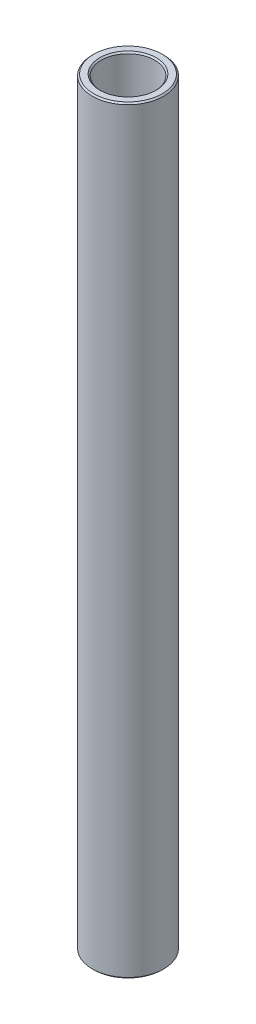
ISO-10303-21;
HEADER;
FILE_DESCRIPTION(('STEP AP214'),'2;1');
FILE_NAME('part.step','',(''),(''),'','','');
FILE_SCHEMA(('AUTOMOTIVE_DESIGN { 1 0 10303 214 1 1 1 1 }'));
ENDSEC;
DATA;
#1=APPLICATION_CONTEXT('core data for automotive mechanical design processes');
#2=APPLICATION_PROTOCOL_DEFINITION('international standard','automotive_design',2000,#1);
#3=PRODUCT_CONTEXT('',#1,'mechanical');
#4=PRODUCT('Part','Part','',(#3));
#5=PRODUCT_RELATED_PRODUCT_CATEGORY('part','',(#4));
#6=PRODUCT_DEFINITION_FORMATION('','',#4);
#7=PRODUCT_DEFINITION_CONTEXT('part definition',#1,'design');
#8=PRODUCT_DEFINITION('design','',#6,#7);
#9=PRODUCT_DEFINITION_SHAPE('','',#8);
#10=(LENGTH_UNIT() NAMED_UNIT(*) SI_UNIT(.MILLI.,.METRE.));
#11=(NAMED_UNIT(*) PLANE_ANGLE_UNIT() SI_UNIT($,.RADIAN.));
#12=(NAMED_UNIT(*) SI_UNIT($,.STERADIAN.) SOLID_ANGLE_UNIT());
#13=UNCERTAINTY_MEASURE_WITH_UNIT(LENGTH_MEASURE(1.E-05),#10,'distance_accuracy_value','');
#14=(GEOMETRIC_REPRESENTATION_CONTEXT(3) GLOBAL_UNCERTAINTY_ASSIGNED_CONTEXT((#13)) GLOBAL_UNIT_ASSIGNED_CONTEXT((#10,
#11,#12)) REPRESENTATION_CONTEXT('',''));
#15=CARTESIAN_POINT('',(0.,0.,0.));
#16=DIRECTION('',(0.,0.,1.));
#17=DIRECTION('',(1.,0.,0.));
#18=AXIS2_PLACEMENT_3D('',#15,#16,#17);
#19=CARTESIAN_POINT('',(6.35000000000029,70.6436949648176,0.));
#20=DIRECTION('',(3.57678411281058E-12,-1.,0.));
#21=DIRECTION('',(1.,3.57678411281058E-12,0.));
#22=AXIS2_PLACEMENT_3D('',#19,#20,#21);
#23=PLANE('',#22);
#24=CARTESIAN_POINT('',(-3.40688686744497E-11,70.6436949647948,0.));
#25=DIRECTION('',(3.57678411281058E-12,-1.,0.));
#26=DIRECTION('',(1.,3.57678411281058E-12,0.));
#27=AXIS2_PLACEMENT_3D('',#24,#25,#26);
#28=CIRCLE('',#27,5.01650000003693);
#29=CARTESIAN_POINT('',(5.01650000000286,70.6436949648128,0.));
#30=VERTEX_POINT('',#29);
#31=EDGE_CURVE('E10',#30,#30,#28,.F.);
#32=ORIENTED_EDGE('',*,*,#31,.T.);
#33=EDGE_LOOP('',(#32));
#34=FACE_BOUND('',#33,.T.);
#35=CARTESIAN_POINT('',(-3.40688686744497E-11,70.6436949647948,0.));
#36=DIRECTION('',(3.57678411281058E-12,-1.,0.));
#37=DIRECTION('',(1.,3.57678411281058E-12,0.));
#38=AXIS2_PLACEMENT_3D('',#35,#36,#37);
#39=CIRCLE('',#38,6.09600000003724);
#40=CARTESIAN_POINT('',(6.09600000000317,70.6436949648166,0.));
#41=VERTEX_POINT('',#40);
#42=EDGE_CURVE('E37',#41,#41,#39,.T.);
#43=ORIENTED_EDGE('',*,*,#42,.T.);
#44=EDGE_LOOP('',(#43));
#45=FACE_BOUND('',#44,.T.);
#46=ADVANCED_FACE('F30',(#34,#45),#23,.T.);
#47=CARTESIAN_POINT('',(0.,61.1186949648147,0.));
#48=DIRECTION('',(3.57678411281058E-12,-1.,0.));
#49=DIRECTION('',(1.,3.57678411281058E-12,0.));
#50=AXIS2_PLACEMENT_3D('',#47,#48,#49);
#51=CYLINDRICAL_SURFACE('',#50,4.7625000002754);
#52=CARTESIAN_POINT('',(-5.15804270676441E-10,205.327641998839,0.));
#53=DIRECTION('',(-3.57678411281066E-12,1.,0.));
#54=DIRECTION('',(-1.,-3.57678411281066E-12,0.));
#55=AXIS2_PLACEMENT_3D('',#52,#53,#54);
#56=CIRCLE('',#55,4.7625000002754);
#57=CARTESIAN_POINT('',(-4.76250000079121,205.327641998822,0.));
#58=VERTEX_POINT('',#57);
#59=EDGE_CURVE('E41',#58,#58,#56,.T.);
#60=ORIENTED_EDGE('',*,*,#59,.T.);
#61=EDGE_LOOP('',(#60));
#62=FACE_BOUND('',#61,.T.);
#63=CARTESIAN_POINT('',(-3.49773718382505E-11,70.8976949645563,0.));
#64=DIRECTION('',(3.57678411281057E-12,-1.,0.));
#65=DIRECTION('',(1.,3.57678411281057E-12,0.));
#66=AXIS2_PLACEMENT_3D('',#63,#64,#65);
#67=CIRCLE('',#66,4.7625000002754);
#68=CARTESIAN_POINT('',(4.76250000024043,70.8976949645734,0.));
#69=VERTEX_POINT('',#68);
#70=EDGE_CURVE('E45',#69,#69,#67,.T.);
#71=ORIENTED_EDGE('',*,*,#70,.T.);
#72=EDGE_LOOP('',(#71));
#73=FACE_BOUND('',#72,.T.);
#74=ADVANCED_FACE('F74',(#62,#73),#51,.F.);
#75=CARTESIAN_POINT('',(4.76250000000001,205.581641999095,0.));
#76=DIRECTION('',(-3.57678411281058E-12,1.,0.));
#77=DIRECTION('',(-1.,-3.57678411281058E-12,0.));
#78=AXIS2_PLACEMENT_3D('',#75,#76,#77);
#79=PLANE('',#78);
#80=CARTESIAN_POINT('',(-5.16712773841948E-10,205.581641999078,0.));
#81=DIRECTION('',(-3.57678411281058E-12,1.,0.));
#82=DIRECTION('',(-1.,-3.57678411281058E-12,0.));
#83=AXIS2_PLACEMENT_3D('',#80,#81,#82);
#84=CIRCLE('',#83,6.09600000051412);
#85=CARTESIAN_POINT('',(-6.09600000103084,205.581641999056,0.));
#86=VERTEX_POINT('',#85);
#87=EDGE_CURVE('E50',#86,#86,#84,.T.);
#88=ORIENTED_EDGE('',*,*,#87,.T.);
#89=EDGE_LOOP('',(#88));
#90=FACE_BOUND('',#89,.T.);
#91=CARTESIAN_POINT('',(-5.16712773841948E-10,205.581641999078,0.));
#92=DIRECTION('',(-3.57678411281058E-12,1.,0.));
#93=DIRECTION('',(-1.,-3.57678411281058E-12,0.));
#94=AXIS2_PLACEMENT_3D('',#91,#92,#93);
#95=CIRCLE('',#94,5.01650000051391);
#96=CARTESIAN_POINT('',(-5.01650000103062,205.58164199906,0.));
#97=VERTEX_POINT('',#96);
#98=EDGE_CURVE('E53',#97,#97,#95,.F.);
#99=ORIENTED_EDGE('',*,*,#98,.T.);
#100=EDGE_LOOP('',(#99));
#101=FACE_BOUND('',#100,.T.);
#102=ADVANCED_FACE('F79',(#90,#101),#79,.T.);
#103=CARTESIAN_POINT('',(0.,61.1186949648147,0.));
#104=DIRECTION('',(3.57678411281058E-12,-1.,0.));
#105=DIRECTION('',(1.,3.57678411281058E-12,0.));
#106=AXIS2_PLACEMENT_3D('',#103,#104,#105);
#107=CYLINDRICAL_SURFACE('',#106,6.35000000027568);
#108=CARTESIAN_POINT('',(-5.15804270678147E-10,205.327641999316,0.));
#109=DIRECTION('',(-3.57678411281063E-12,1.,0.));
#110=DIRECTION('',(-1.,-3.57678411281063E-12,0.));
#111=AXIS2_PLACEMENT_3D('',#108,#109,#110);
#112=CIRCLE('',#111,6.35000000027568);
#113=CARTESIAN_POINT('',(-6.35000000079148,205.327641999294,0.));
#114=VERTEX_POINT('',#113);
#115=EDGE_CURVE('E56',#114,#114,#112,.F.);
#116=ORIENTED_EDGE('',*,*,#115,.T.);
#117=EDGE_LOOP('',(#116));
#118=FACE_BOUND('',#117,.T.);
#119=CARTESIAN_POINT('',(-3.49773718399564E-11,70.8976949650333,0.));
#120=DIRECTION('',(3.57678411281056E-12,-1.,0.));
#121=DIRECTION('',(1.,3.57678411281056E-12,0.));
#122=AXIS2_PLACEMENT_3D('',#119,#120,#121);
#123=CIRCLE('',#122,6.35000000027568);
#124=CARTESIAN_POINT('',(6.3500000002407,70.897694965056,0.));
#125=VERTEX_POINT('',#124);
#126=EDGE_CURVE('E59',#125,#125,#123,.F.);
#127=ORIENTED_EDGE('',*,*,#126,.T.);
#128=EDGE_LOOP('',(#127));
#129=FACE_BOUND('',#128,.T.);
#130=ADVANCED_FACE('F63',(#118,#129),#107,.T.);
#131=CARTESIAN_POINT('',(-5.15804270678147E-10,205.327641999316,0.));
#132=DIRECTION('',(3.57678411281063E-12,-1.,0.));
#133=DIRECTION('',(1.,3.57678411281063E-12,0.));
#134=AXIS2_PLACEMENT_3D('',#131,#132,#133);
#135=CONICAL_SURFACE('',#134,6.35000000027568,0.785398163397424);
#136=ORIENTED_EDGE('',*,*,#87,.F.);
#137=EDGE_LOOP('',(#136));
#138=FACE_BOUND('',#137,.T.);
#139=ORIENTED_EDGE('',*,*,#115,.F.);
#140=EDGE_LOOP('',(#139));
#141=FACE_BOUND('',#140,.T.);
#142=ADVANCED_FACE('F84',(#138,#141),#135,.T.);
#143=CARTESIAN_POINT('',(-5.16712773841948E-10,205.581641999078,0.));
#144=DIRECTION('',(-3.57678411281066E-12,1.,0.));
#145=DIRECTION('',(-1.,-3.57678411281066E-12,0.));
#146=AXIS2_PLACEMENT_3D('',#143,#144,#145);
#147=CONICAL_SURFACE('',#146,5.0165000005139,0.785398163397426);
#148=ORIENTED_EDGE('',*,*,#59,.F.);
#149=EDGE_LOOP('',(#148));
#150=FACE_BOUND('',#149,.T.);
#151=ORIENTED_EDGE('',*,*,#98,.F.);
#152=EDGE_LOOP('',(#151));
#153=FACE_BOUND('',#152,.T.);
#154=ADVANCED_FACE('F71',(#150,#153),#147,.F.);
#155=CARTESIAN_POINT('',(-3.49773718382506E-11,70.8976949645564,0.));
#156=DIRECTION('',(3.57678411281057E-12,-1.,0.));
#157=DIRECTION('',(1.,3.57678411281057E-12,0.));
#158=AXIS2_PLACEMENT_3D('',#155,#156,#157);
#159=CONICAL_SURFACE('',#158,4.7625000002754,0.785398163397481);
#160=ORIENTED_EDGE('',*,*,#31,.F.);
#161=EDGE_LOOP('',(#160));
#162=FACE_BOUND('',#161,.T.);
#163=ORIENTED_EDGE('',*,*,#70,.F.);
#164=EDGE_LOOP('',(#163));
#165=FACE_BOUND('',#164,.T.);
#166=ADVANCED_FACE('F67',(#162,#165),#159,.F.);
#167=CARTESIAN_POINT('',(-3.40688686744497E-11,70.6436949647948,0.));
#168=DIRECTION('',(-3.57678411281056E-12,1.,0.));
#169=DIRECTION('',(-1.,-3.57678411281056E-12,0.));
#170=AXIS2_PLACEMENT_3D('',#167,#168,#169);
#171=CONICAL_SURFACE('',#170,6.09600000003724,0.78539816339745);
#172=ORIENTED_EDGE('',*,*,#126,.F.);
#173=EDGE_LOOP('',(#172));
#174=FACE_BOUND('',#173,.T.);
#175=ORIENTED_EDGE('',*,*,#42,.F.);
#176=EDGE_LOOP('',(#175));
#177=FACE_BOUND('',#176,.T.);
#178=ADVANCED_FACE('F32',(#174,#177),#171,.T.);
#179=CLOSED_SHELL('',(#46,#74,#102,#130,#142,#154,#166,#178));
#180=MANIFOLD_SOLID_BREP('B2',#179);
#181=ADVANCED_BREP_SHAPE_REPRESENTATION('',(#18,#180),#14);
#182=SHAPE_DEFINITION_REPRESENTATION(#9,#181);
ENDSEC;
END-ISO-10303-21;
